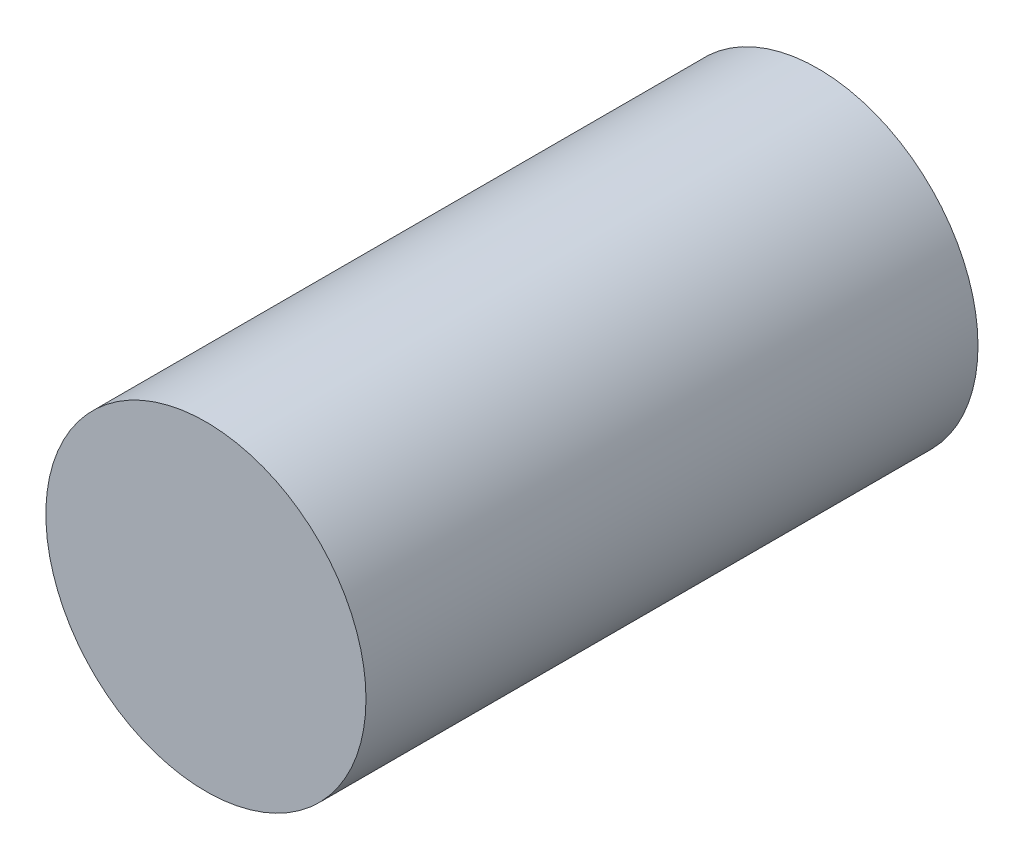
ISO-10303-21;
HEADER;
FILE_DESCRIPTION(('STEP AP214'),'2;1');
FILE_NAME('part.step','',(''),(''),'','','');
FILE_SCHEMA(('AUTOMOTIVE_DESIGN { 1 0 10303 214 1 1 1 1 }'));
ENDSEC;
DATA;
#1=APPLICATION_CONTEXT('core data for automotive mechanical design processes');
#2=APPLICATION_PROTOCOL_DEFINITION('international standard','automotive_design',2000,#1);
#3=PRODUCT_CONTEXT('',#1,'mechanical');
#4=PRODUCT('Part','Part','',(#3));
#5=PRODUCT_RELATED_PRODUCT_CATEGORY('part','',(#4));
#6=PRODUCT_DEFINITION_FORMATION('','',#4);
#7=PRODUCT_DEFINITION_CONTEXT('part definition',#1,'design');
#8=PRODUCT_DEFINITION('design','',#6,#7);
#9=PRODUCT_DEFINITION_SHAPE('','',#8);
#10=(LENGTH_UNIT() NAMED_UNIT(*) SI_UNIT(.MILLI.,.METRE.));
#11=(NAMED_UNIT(*) PLANE_ANGLE_UNIT() SI_UNIT($,.RADIAN.));
#12=(NAMED_UNIT(*) SI_UNIT($,.STERADIAN.) SOLID_ANGLE_UNIT());
#13=UNCERTAINTY_MEASURE_WITH_UNIT(LENGTH_MEASURE(1.E-05),#10,'distance_accuracy_value','');
#14=(GEOMETRIC_REPRESENTATION_CONTEXT(3) GLOBAL_UNCERTAINTY_ASSIGNED_CONTEXT((#13)) GLOBAL_UNIT_ASSIGNED_CONTEXT((#10,
#11,#12)) REPRESENTATION_CONTEXT('',''));
#15=CARTESIAN_POINT('',(0.,0.,0.));
#16=DIRECTION('',(0.,0.,1.));
#17=DIRECTION('',(1.,0.,0.));
#18=AXIS2_PLACEMENT_3D('',#15,#16,#17);
#19=CARTESIAN_POINT('',(0.,0.,65.));
#20=DIRECTION('',(0.,0.,-1.));
#21=DIRECTION('',(-1.,0.,0.));
#22=AXIS2_PLACEMENT_3D('',#19,#20,#21);
#23=CYLINDRICAL_SURFACE('',#22,17.);
#24=CARTESIAN_POINT('',(0.,0.,65.));
#25=DIRECTION('',(0.,0.,1.));
#26=DIRECTION('',(1.,0.,0.));
#27=AXIS2_PLACEMENT_3D('',#24,#25,#26);
#28=CIRCLE('',#27,17.);
#29=CARTESIAN_POINT('',(17.,0.,65.));
#30=VERTEX_POINT('',#29);
#31=EDGE_CURVE('E10',#30,#30,#28,.T.);
#32=ORIENTED_EDGE('',*,*,#31,.F.);
#33=EDGE_LOOP('',(#32));
#34=FACE_BOUND('',#33,.T.);
#35=CARTESIAN_POINT('',(0.,0.,0.));
#36=DIRECTION('',(0.,0.,1.));
#37=DIRECTION('',(1.,0.,0.));
#38=AXIS2_PLACEMENT_3D('',#35,#36,#37);
#39=CIRCLE('',#38,17.);
#40=CARTESIAN_POINT('',(17.,0.,0.));
#41=VERTEX_POINT('',#40);
#42=EDGE_CURVE('E34',#41,#41,#39,.T.);
#43=ORIENTED_EDGE('',*,*,#42,.T.);
#44=EDGE_LOOP('',(#43));
#45=FACE_BOUND('',#44,.T.);
#46=ADVANCED_FACE('F31',(#34,#45),#23,.T.);
#47=CARTESIAN_POINT('',(0.,0.,65.));
#48=DIRECTION('',(0.,0.,1.));
#49=DIRECTION('',(1.,0.,0.));
#50=AXIS2_PLACEMENT_3D('',#47,#48,#49);
#51=PLANE('',#50);
#52=ORIENTED_EDGE('',*,*,#31,.T.);
#53=EDGE_LOOP('',(#52));
#54=FACE_BOUND('',#53,.T.);
#55=ADVANCED_FACE('F46',(#54),#51,.T.);
#56=CARTESIAN_POINT('',(0.,0.,0.));
#57=DIRECTION('',(0.,0.,1.));
#58=DIRECTION('',(1.,0.,0.));
#59=AXIS2_PLACEMENT_3D('',#56,#57,#58);
#60=PLANE('',#59);
#61=ORIENTED_EDGE('',*,*,#42,.F.);
#62=EDGE_LOOP('',(#61));
#63=FACE_BOUND('',#62,.T.);
#64=ADVANCED_FACE('F44',(#63),#60,.F.);
#65=CLOSED_SHELL('',(#46,#55,#64));
#66=MANIFOLD_SOLID_BREP('B2',#65);
#67=ADVANCED_BREP_SHAPE_REPRESENTATION('',(#18,#66),#14);
#68=SHAPE_DEFINITION_REPRESENTATION(#9,#67);
ENDSEC;
END-ISO-10303-21;
